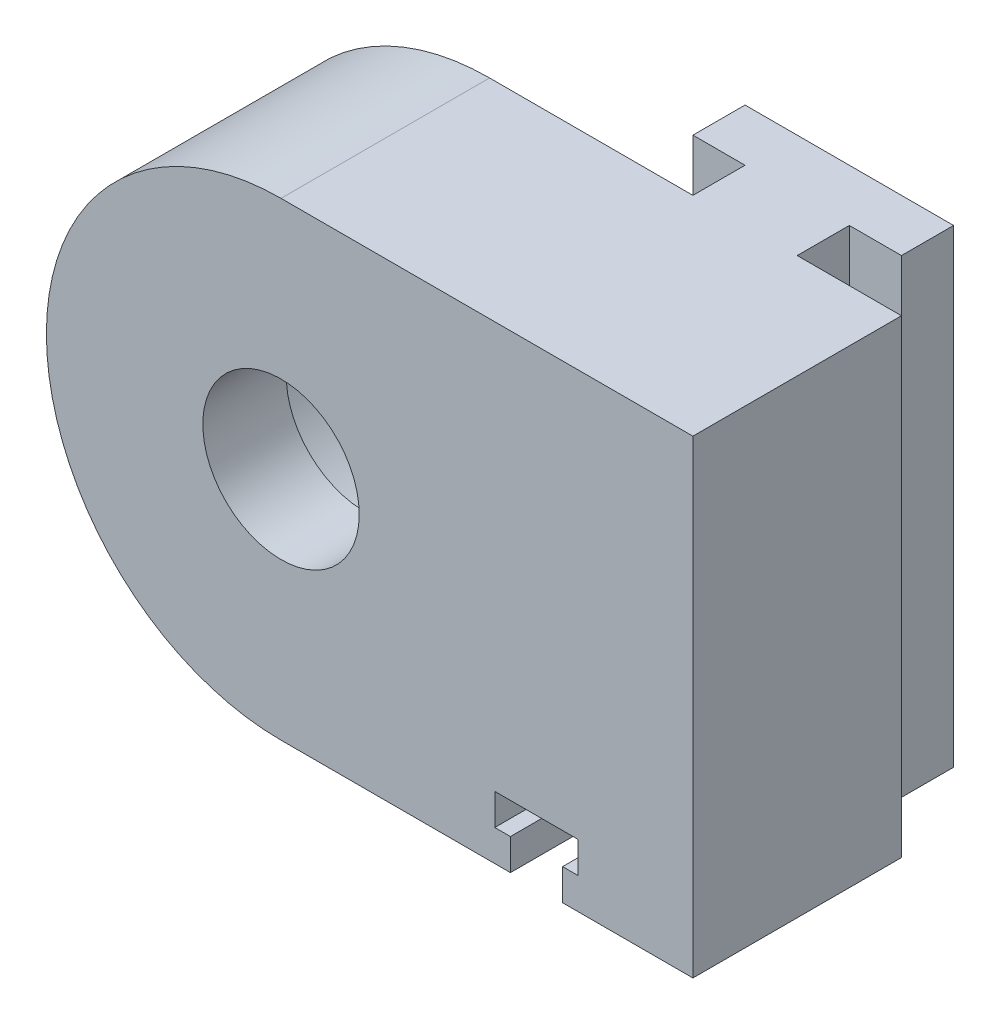
ISO-10303-21;
HEADER;
FILE_DESCRIPTION(('STEP AP214'),'2;1');
FILE_NAME('part.step','',(''),(''),'','','');
FILE_SCHEMA(('AUTOMOTIVE_DESIGN { 1 0 10303 214 1 1 1 1 }'));
ENDSEC;
DATA;
#1=APPLICATION_CONTEXT('core data for automotive mechanical design processes');
#2=APPLICATION_PROTOCOL_DEFINITION('international standard','automotive_design',2000,#1);
#3=PRODUCT_CONTEXT('',#1,'mechanical');
#4=PRODUCT('Part','Part','',(#3));
#5=PRODUCT_RELATED_PRODUCT_CATEGORY('part','',(#4));
#6=PRODUCT_DEFINITION_FORMATION('','',#4);
#7=PRODUCT_DEFINITION_CONTEXT('part definition',#1,'design');
#8=PRODUCT_DEFINITION('design','',#6,#7);
#9=PRODUCT_DEFINITION_SHAPE('','',#8);
#10=(LENGTH_UNIT() NAMED_UNIT(*) SI_UNIT(.MILLI.,.METRE.));
#11=(NAMED_UNIT(*) PLANE_ANGLE_UNIT() SI_UNIT($,.RADIAN.));
#12=(NAMED_UNIT(*) SI_UNIT($,.STERADIAN.) SOLID_ANGLE_UNIT());
#13=UNCERTAINTY_MEASURE_WITH_UNIT(LENGTH_MEASURE(1.E-05),#10,'distance_accuracy_value','');
#14=(GEOMETRIC_REPRESENTATION_CONTEXT(3) GLOBAL_UNCERTAINTY_ASSIGNED_CONTEXT((#13)) GLOBAL_UNIT_ASSIGNED_CONTEXT((#10,
#11,#12)) REPRESENTATION_CONTEXT('',''));
#15=CARTESIAN_POINT('',(0.,0.,0.));
#16=DIRECTION('',(0.,0.,1.));
#17=DIRECTION('',(1.,0.,0.));
#18=AXIS2_PLACEMENT_3D('',#15,#16,#17);
#19=CARTESIAN_POINT('',(-634.508066615171,-1.99999999999969,10.));
#20=DIRECTION('',(0.,0.,1.));
#21=DIRECTION('',(1.,0.,0.));
#22=AXIS2_PLACEMENT_3D('',#19,#20,#21);
#23=PLANE('',#22);
#24=CARTESIAN_POINT('',(-634.508066615171,-1.99999999999969,10.));
#25=DIRECTION('',(0.,0.,1.));
#26=DIRECTION('',(1.,0.,0.));
#27=AXIS2_PLACEMENT_3D('',#24,#25,#26);
#28=CIRCLE('',#27,7.49999999999996);
#29=CARTESIAN_POINT('',(-627.008066615171,-1.99999999999969,10.));
#30=VERTEX_POINT('',#29);
#31=EDGE_CURVE('E315',#30,#30,#28,.T.);
#32=ORIENTED_EDGE('',*,*,#31,.F.);
#33=EDGE_LOOP('',(#32));
#34=FACE_BOUND('',#33,.T.);
#35=DIRECTION('',(-1.,0.,0.));
#36=VECTOR('',#35,1.);
#37=CARTESIAN_POINT('',(-595.008671928237,-24.4999999999993,10.));
#38=LINE('',#37,#36);
#39=CARTESIAN_POINT('',(-612.508671928237,-24.4999999999993,10.));
#40=VERTEX_POINT('',#39);
#41=CARTESIAN_POINT('',(-634.508066615171,-24.4999999999993,10.));
#42=VERTEX_POINT('',#41);
#43=EDGE_CURVE('E326',#40,#42,#38,.T.);
#44=ORIENTED_EDGE('',*,*,#43,.F.);
#45=DIRECTION('',(0.,-1.,0.));
#46=VECTOR('',#45,1.);
#47=CARTESIAN_POINT('',(-612.508671928236,2.26673743452435E-11,10.));
#48=LINE('',#47,#46);
#49=CARTESIAN_POINT('',(-612.508671928237,-21.4999999999993,10.));
#50=VERTEX_POINT('',#49);
#51=EDGE_CURVE('E225',#50,#40,#48,.T.);
#52=ORIENTED_EDGE('',*,*,#51,.F.);
#53=DIRECTION('',(1.,0.,0.));
#54=VECTOR('',#53,1.);
#55=CARTESIAN_POINT('',(0.,-21.4999999999993,10.));
#56=LINE('',#55,#54);
#57=CARTESIAN_POINT('',(-614.008671928237,-21.4999999999993,10.));
#58=VERTEX_POINT('',#57);
#59=EDGE_CURVE('E223',#58,#50,#56,.T.);
#60=ORIENTED_EDGE('',*,*,#59,.F.);
#61=DIRECTION('',(0.,1.,0.));
#62=VECTOR('',#61,1.);
#63=CARTESIAN_POINT('',(-614.008671928237,0.,10.));
#64=LINE('',#63,#62);
#65=CARTESIAN_POINT('',(-614.008671928237,-18.4999999999993,10.));
#66=VERTEX_POINT('',#65);
#67=EDGE_CURVE('E191',#58,#66,#64,.T.);
#68=ORIENTED_EDGE('',*,*,#67,.T.);
#69=DIRECTION('',(1.,0.,0.));
#70=VECTOR('',#69,1.);
#71=CARTESIAN_POINT('',(0.,-18.4999999999993,10.));
#72=LINE('',#71,#70);
#73=CARTESIAN_POINT('',(-606.008671928237,-18.4999999999993,10.));
#74=VERTEX_POINT('',#73);
#75=EDGE_CURVE('E236',#66,#74,#72,.T.);
#76=ORIENTED_EDGE('',*,*,#75,.T.);
#77=DIRECTION('',(0.,-1.,0.));
#78=VECTOR('',#77,1.);
#79=CARTESIAN_POINT('',(-606.008671928237,0.,10.));
#80=LINE('',#79,#78);
#81=CARTESIAN_POINT('',(-606.008671928237,-21.4999999999993,10.));
#82=VERTEX_POINT('',#81);
#83=EDGE_CURVE('E233',#74,#82,#80,.T.);
#84=ORIENTED_EDGE('',*,*,#83,.T.);
#85=DIRECTION('',(-1.,0.,0.));
#86=VECTOR('',#85,1.);
#87=CARTESIAN_POINT('',(0.,-21.4999999999993,10.));
#88=LINE('',#87,#86);
#89=CARTESIAN_POINT('',(-607.508671928237,-21.4999999999993,10.));
#90=VERTEX_POINT('',#89);
#91=EDGE_CURVE('E230',#82,#90,#88,.T.);
#92=ORIENTED_EDGE('',*,*,#91,.T.);
#93=DIRECTION('',(0.,-1.,0.));
#94=VECTOR('',#93,1.);
#95=CARTESIAN_POINT('',(-607.508671928237,0.,10.));
#96=LINE('',#95,#94);
#97=CARTESIAN_POINT('',(-607.508671928237,-24.4999999999993,10.));
#98=VERTEX_POINT('',#97);
#99=EDGE_CURVE('E227',#90,#98,#96,.T.);
#100=ORIENTED_EDGE('',*,*,#99,.T.);
#101=CARTESIAN_POINT('',(-595.008671928237,-24.4999999999993,10.));
#102=VERTEX_POINT('',#101);
#103=EDGE_CURVE('E327',#102,#98,#38,.T.);
#104=ORIENTED_EDGE('',*,*,#103,.F.);
#105=DIRECTION('',(0.,-1.,0.));
#106=VECTOR('',#105,1.);
#107=CARTESIAN_POINT('',(-595.008671928237,20.4999999999999,10.));
#108=LINE('',#107,#106);
#109=CARTESIAN_POINT('',(-595.008671928237,20.4999999999999,10.));
#110=VERTEX_POINT('',#109);
#111=EDGE_CURVE('E322',#110,#102,#108,.T.);
#112=ORIENTED_EDGE('',*,*,#111,.F.);
#113=DIRECTION('',(1.,0.,0.));
#114=VECTOR('',#113,1.);
#115=CARTESIAN_POINT('',(-634.508066615171,20.4999999999999,10.));
#116=LINE('',#115,#114);
#117=CARTESIAN_POINT('',(-634.508066615171,20.4999999999999,10.));
#118=VERTEX_POINT('',#117);
#119=EDGE_CURVE('E319',#118,#110,#116,.T.);
#120=ORIENTED_EDGE('',*,*,#119,.F.);
#121=CARTESIAN_POINT('',(-634.508066615171,-1.99999999999969,10.));
#122=DIRECTION('',(0.,0.,1.));
#123=DIRECTION('',(1.,0.,0.));
#124=AXIS2_PLACEMENT_3D('',#121,#122,#123);
#125=CIRCLE('',#124,22.4999999999996);
#126=EDGE_CURVE('E330',#118,#42,#125,.T.);
#127=ORIENTED_EDGE('',*,*,#126,.T.);
#128=EDGE_LOOP('',(#44,#52,#60,#68,#76,#84,#92,#100,#104,#112,#120,#127));
#129=FACE_BOUND('',#128,.T.);
#130=ADVANCED_FACE('F51',(#34,#129),#23,.T.);
#131=CARTESIAN_POINT('',(-595.008671928237,-24.4999999999993,10.));
#132=DIRECTION('',(0.,-1.,0.));
#133=DIRECTION('',(1.,0.,0.));
#134=AXIS2_PLACEMENT_3D('',#131,#132,#133);
#135=PLANE('',#134);
#136=DIRECTION('',(-1.,0.,0.));
#137=VECTOR('',#136,1.);
#138=CARTESIAN_POINT('',(-600.008671928237,-24.5000000000001,-20.));
#139=LINE('',#138,#137);
#140=CARTESIAN_POINT('',(-612.508671928237,-24.4999999999993,-20.));
#141=VERTEX_POINT('',#140);
#142=CARTESIAN_POINT('',(-620.008671928237,-24.5000000000001,-20.));
#143=VERTEX_POINT('',#142);
#144=EDGE_CURVE('E263',#141,#143,#139,.T.);
#145=ORIENTED_EDGE('',*,*,#144,.F.);
#146=DIRECTION('',(0.,0.,-1.));
#147=VECTOR('',#146,1.);
#148=CARTESIAN_POINT('',(-612.508671928237,-24.4999999999993,10.));
#149=LINE('',#148,#147);
#150=EDGE_CURVE('E250',#40,#141,#149,.T.);
#151=ORIENTED_EDGE('',*,*,#150,.F.);
#152=ORIENTED_EDGE('',*,*,#43,.T.);
#153=DIRECTION('',(0.,0.,-1.));
#154=VECTOR('',#153,1.);
#155=CARTESIAN_POINT('',(-634.508066615171,-24.4999999999993,10.));
#156=LINE('',#155,#154);
#157=CARTESIAN_POINT('',(-634.508066615171,-24.4999999999993,-10.));
#158=VERTEX_POINT('',#157);
#159=EDGE_CURVE('E60',#42,#158,#156,.T.);
#160=ORIENTED_EDGE('',*,*,#159,.T.);
#161=DIRECTION('',(-1.,0.,0.));
#162=VECTOR('',#161,1.);
#163=CARTESIAN_POINT('',(-595.008671928237,-24.4999999999993,-10.));
#164=LINE('',#163,#162);
#165=CARTESIAN_POINT('',(-615.008671928237,-24.5000000000001,-10.));
#166=VERTEX_POINT('',#165);
#167=EDGE_CURVE('E340',#166,#158,#164,.T.);
#168=ORIENTED_EDGE('',*,*,#167,.F.);
#169=DIRECTION('',(0.,0.,1.));
#170=VECTOR('',#169,1.);
#171=CARTESIAN_POINT('',(-615.008671928237,-24.5000000000001,-15.));
#172=LINE('',#171,#170);
#173=CARTESIAN_POINT('',(-615.008671928237,-24.5000000000001,-15.));
#174=VERTEX_POINT('',#173);
#175=EDGE_CURVE('E273',#174,#166,#172,.T.);
#176=ORIENTED_EDGE('',*,*,#175,.F.);
#177=DIRECTION('',(1.,0.,0.));
#178=VECTOR('',#177,1.);
#179=CARTESIAN_POINT('',(-620.008671928237,-24.5000000000001,-15.));
#180=LINE('',#179,#178);
#181=CARTESIAN_POINT('',(-620.008671928237,-24.5000000000001,-15.));
#182=VERTEX_POINT('',#181);
#183=EDGE_CURVE('E270',#182,#174,#180,.T.);
#184=ORIENTED_EDGE('',*,*,#183,.F.);
#185=DIRECTION('',(0.,0.,1.));
#186=VECTOR('',#185,1.);
#187=CARTESIAN_POINT('',(-620.008671928237,-24.5000000000001,-20.));
#188=LINE('',#187,#186);
#189=EDGE_CURVE('E267',#143,#182,#188,.T.);
#190=ORIENTED_EDGE('',*,*,#189,.F.);
#191=EDGE_LOOP('',(#145,#151,#152,#160,#168,#176,#184,#190));
#192=FACE_BOUND('',#191,.T.);
#193=ADVANCED_FACE('F393',(#192),#135,.T.);
#194=CARTESIAN_POINT('',(-600.008671928237,-24.5000000000001,-20.));
#195=DIRECTION('',(0.,0.,-1.));
#196=DIRECTION('',(-1.,0.,0.));
#197=AXIS2_PLACEMENT_3D('',#194,#195,#196);
#198=PLANE('',#197);
#199=DIRECTION('',(1.,0.,0.));
#200=VECTOR('',#199,1.);
#201=CARTESIAN_POINT('',(0.,-21.4999999999993,-20.));
#202=LINE('',#201,#200);
#203=CARTESIAN_POINT('',(-614.008671928237,-21.4999999999993,-20.));
#204=VERTEX_POINT('',#203);
#205=CARTESIAN_POINT('',(-612.508671928237,-21.4999999999993,-20.));
#206=VERTEX_POINT('',#205);
#207=EDGE_CURVE('E197',#204,#206,#202,.T.);
#208=ORIENTED_EDGE('',*,*,#207,.T.);
#209=DIRECTION('',(0.,-1.,0.));
#210=VECTOR('',#209,1.);
#211=CARTESIAN_POINT('',(-612.508671928236,2.26673743452435E-11,-20.));
#212=LINE('',#211,#210);
#213=EDGE_CURVE('E203',#206,#141,#212,.T.);
#214=ORIENTED_EDGE('',*,*,#213,.T.);
#215=ORIENTED_EDGE('',*,*,#144,.T.);
#216=DIRECTION('',(0.,1.,0.));
#217=VECTOR('',#216,1.);
#218=CARTESIAN_POINT('',(-620.008671928237,-24.5000000000001,-20.));
#219=LINE('',#218,#217);
#220=CARTESIAN_POINT('',(-620.008671928237,20.4999999999999,-20.));
#221=VERTEX_POINT('',#220);
#222=EDGE_CURVE('E301',#143,#221,#219,.T.);
#223=ORIENTED_EDGE('',*,*,#222,.T.);
#224=DIRECTION('',(-1.,0.,0.));
#225=VECTOR('',#224,1.);
#226=CARTESIAN_POINT('',(-600.008671928237,20.4999999999999,-20.));
#227=LINE('',#226,#225);
#228=CARTESIAN_POINT('',(-600.008671928237,20.4999999999999,-20.));
#229=VERTEX_POINT('',#228);
#230=EDGE_CURVE('E283',#229,#221,#227,.T.);
#231=ORIENTED_EDGE('',*,*,#230,.F.);
#232=DIRECTION('',(0.,1.,0.));
#233=VECTOR('',#232,1.);
#234=CARTESIAN_POINT('',(-600.008671928237,-24.5000000000001,-20.));
#235=LINE('',#234,#233);
#236=CARTESIAN_POINT('',(-600.008671928237,-24.5000000000001,-20.));
#237=VERTEX_POINT('',#236);
#238=EDGE_CURVE('E303',#237,#229,#235,.T.);
#239=ORIENTED_EDGE('',*,*,#238,.F.);
#240=CARTESIAN_POINT('',(-607.508671928237,-24.4999999999993,-20.));
#241=VERTEX_POINT('',#240);
#242=EDGE_CURVE('E264',#237,#241,#139,.T.);
#243=ORIENTED_EDGE('',*,*,#242,.T.);
#244=DIRECTION('',(0.,-1.,0.));
#245=VECTOR('',#244,1.);
#246=CARTESIAN_POINT('',(-607.508671928237,0.,-20.));
#247=LINE('',#246,#245);
#248=CARTESIAN_POINT('',(-607.508671928237,-21.4999999999993,-20.));
#249=VERTEX_POINT('',#248);
#250=EDGE_CURVE('E213',#249,#241,#247,.T.);
#251=ORIENTED_EDGE('',*,*,#250,.F.);
#252=DIRECTION('',(-1.,0.,0.));
#253=VECTOR('',#252,1.);
#254=CARTESIAN_POINT('',(0.,-21.4999999999993,-20.));
#255=LINE('',#254,#253);
#256=CARTESIAN_POINT('',(-606.008671928237,-21.4999999999993,-20.));
#257=VERTEX_POINT('',#256);
#258=EDGE_CURVE('E215',#257,#249,#255,.T.);
#259=ORIENTED_EDGE('',*,*,#258,.F.);
#260=DIRECTION('',(0.,-1.,0.));
#261=VECTOR('',#260,1.);
#262=CARTESIAN_POINT('',(-606.008671928237,0.,-20.));
#263=LINE('',#262,#261);
#264=CARTESIAN_POINT('',(-606.008671928237,-18.4999999999993,-20.));
#265=VERTEX_POINT('',#264);
#266=EDGE_CURVE('E218',#265,#257,#263,.T.);
#267=ORIENTED_EDGE('',*,*,#266,.F.);
#268=DIRECTION('',(1.,0.,0.));
#269=VECTOR('',#268,1.);
#270=CARTESIAN_POINT('',(0.,-18.4999999999993,-20.));
#271=LINE('',#270,#269);
#272=CARTESIAN_POINT('',(-614.008671928237,-18.4999999999993,-20.));
#273=VERTEX_POINT('',#272);
#274=EDGE_CURVE('E209',#273,#265,#271,.T.);
#275=ORIENTED_EDGE('',*,*,#274,.F.);
#276=DIRECTION('',(0.,1.,0.));
#277=VECTOR('',#276,1.);
#278=CARTESIAN_POINT('',(-614.008671928237,0.,-20.));
#279=LINE('',#278,#277);
#280=EDGE_CURVE('E68',#204,#273,#279,.T.);
#281=ORIENTED_EDGE('',*,*,#280,.F.);
#282=EDGE_LOOP('',(#208,#214,#215,#223,#231,#239,#243,#251,#259,#267,#275,#281));
#283=FACE_BOUND('',#282,.T.);
#284=ADVANCED_FACE('F206',(#283),#198,.T.);
#285=CARTESIAN_POINT('',(-634.508066615171,-1.99999999999969,-10.));
#286=DIRECTION('',(0.,0.,1.));
#287=DIRECTION('',(1.,0.,0.));
#288=AXIS2_PLACEMENT_3D('',#285,#286,#287);
#289=PLANE('',#288);
#290=CARTESIAN_POINT('',(-634.508066615171,-1.99999999999969,-10.));
#291=DIRECTION('',(0.,0.,1.));
#292=DIRECTION('',(1.,0.,0.));
#293=AXIS2_PLACEMENT_3D('',#290,#291,#292);
#294=CIRCLE('',#293,14.);
#295=CARTESIAN_POINT('',(-620.508066615171,-1.99999999999969,-10.));
#296=VERTEX_POINT('',#295);
#297=EDGE_CURVE('E296',#296,#296,#294,.T.);
#298=ORIENTED_EDGE('',*,*,#297,.T.);
#299=EDGE_LOOP('',(#298));
#300=FACE_BOUND('',#299,.T.);
#301=DIRECTION('',(0.,1.,0.));
#302=VECTOR('',#301,1.);
#303=CARTESIAN_POINT('',(-615.008671928237,-24.5000000000001,-10.));
#304=LINE('',#303,#302);
#305=CARTESIAN_POINT('',(-615.008671928237,20.4999999999999,-10.));
#306=VERTEX_POINT('',#305);
#307=EDGE_CURVE('E294',#166,#306,#304,.T.);
#308=ORIENTED_EDGE('',*,*,#307,.F.);
#309=ORIENTED_EDGE('',*,*,#167,.T.);
#310=CARTESIAN_POINT('',(-634.508066615171,-1.99999999999969,-10.));
#311=DIRECTION('',(0.,0.,1.));
#312=DIRECTION('',(1.,0.,0.));
#313=AXIS2_PLACEMENT_3D('',#310,#311,#312);
#314=CIRCLE('',#313,22.4999999999996);
#315=CARTESIAN_POINT('',(-634.508066615171,20.4999999999999,-10.));
#316=VERTEX_POINT('',#315);
#317=EDGE_CURVE('E323',#316,#158,#314,.T.);
#318=ORIENTED_EDGE('',*,*,#317,.F.);
#319=DIRECTION('',(1.,0.,0.));
#320=VECTOR('',#319,1.);
#321=CARTESIAN_POINT('',(-634.508066615171,20.4999999999999,-10.));
#322=LINE('',#321,#320);
#323=EDGE_CURVE('E334',#316,#306,#322,.T.);
#324=ORIENTED_EDGE('',*,*,#323,.T.);
#325=EDGE_LOOP('',(#308,#309,#318,#324));
#326=FACE_BOUND('',#325,.T.);
#327=ADVANCED_FACE('F390',(#300,#326),#289,.F.);
#328=CARTESIAN_POINT('',(-595.008671928237,-24.4999999999993,-10.));
#329=VERTEX_POINT('',#328);
#330=CARTESIAN_POINT('',(-605.008671928237,-24.5000000000001,-10.));
#331=VERTEX_POINT('',#330);
#332=EDGE_CURVE('E341',#329,#331,#164,.T.);
#333=ORIENTED_EDGE('',*,*,#332,.T.);
#334=DIRECTION('',(0.,1.,0.));
#335=VECTOR('',#334,1.);
#336=CARTESIAN_POINT('',(-605.008671928237,-24.5000000000001,-10.));
#337=LINE('',#336,#335);
#338=CARTESIAN_POINT('',(-605.008671928237,20.4999999999999,-10.));
#339=VERTEX_POINT('',#338);
#340=EDGE_CURVE('E275',#331,#339,#337,.T.);
#341=ORIENTED_EDGE('',*,*,#340,.T.);
#342=CARTESIAN_POINT('',(-595.008671928237,20.4999999999999,-10.));
#343=VERTEX_POINT('',#342);
#344=EDGE_CURVE('E318',#339,#343,#322,.T.);
#345=ORIENTED_EDGE('',*,*,#344,.T.);
#346=DIRECTION('',(0.,-1.,0.));
#347=VECTOR('',#346,1.);
#348=CARTESIAN_POINT('',(-595.008671928237,20.4999999999999,-10.));
#349=LINE('',#348,#347);
#350=EDGE_CURVE('E337',#343,#329,#349,.T.);
#351=ORIENTED_EDGE('',*,*,#350,.T.);
#352=EDGE_LOOP('',(#333,#341,#345,#351));
#353=FACE_BOUND('',#352,.T.);
#354=ADVANCED_FACE('F360',(#353),#289,.F.);
#355=CARTESIAN_POINT('',(-634.508066615171,20.4999999999999,10.));
#356=DIRECTION('',(0.,1.,0.));
#357=DIRECTION('',(0.,0.,1.));
#358=AXIS2_PLACEMENT_3D('',#355,#356,#357);
#359=PLANE('',#358);
#360=ORIENTED_EDGE('',*,*,#323,.F.);
#361=DIRECTION('',(0.,0.,-1.));
#362=VECTOR('',#361,1.);
#363=CARTESIAN_POINT('',(-634.508066615171,20.4999999999999,10.));
#364=LINE('',#363,#362);
#365=EDGE_CURVE('E12',#118,#316,#364,.T.);
#366=ORIENTED_EDGE('',*,*,#365,.F.);
#367=ORIENTED_EDGE('',*,*,#119,.T.);
#368=DIRECTION('',(0.,0.,-1.));
#369=VECTOR('',#368,1.);
#370=CARTESIAN_POINT('',(-595.008671928237,20.4999999999999,10.));
#371=LINE('',#370,#369);
#372=EDGE_CURVE('E333',#110,#343,#371,.T.);
#373=ORIENTED_EDGE('',*,*,#372,.T.);
#374=ORIENTED_EDGE('',*,*,#344,.F.);
#375=DIRECTION('',(0.,0.,-1.));
#376=VECTOR('',#375,1.);
#377=CARTESIAN_POINT('',(-605.008671928237,20.4999999999999,-10.));
#378=LINE('',#377,#376);
#379=CARTESIAN_POINT('',(-605.008671928237,20.4999999999999,-15.));
#380=VERTEX_POINT('',#379);
#381=EDGE_CURVE('E76',#339,#380,#378,.T.);
#382=ORIENTED_EDGE('',*,*,#381,.T.);
#383=DIRECTION('',(1.,0.,0.));
#384=VECTOR('',#383,1.);
#385=CARTESIAN_POINT('',(-605.008671928237,20.4999999999999,-15.));
#386=LINE('',#385,#384);
#387=CARTESIAN_POINT('',(-600.008671928237,20.4999999999999,-15.));
#388=VERTEX_POINT('',#387);
#389=EDGE_CURVE('E277',#380,#388,#386,.T.);
#390=ORIENTED_EDGE('',*,*,#389,.T.);
#391=DIRECTION('',(0.,0.,-1.));
#392=VECTOR('',#391,1.);
#393=CARTESIAN_POINT('',(-600.008671928237,20.4999999999999,-15.));
#394=LINE('',#393,#392);
#395=EDGE_CURVE('E280',#388,#229,#394,.T.);
#396=ORIENTED_EDGE('',*,*,#395,.T.);
#397=ORIENTED_EDGE('',*,*,#230,.T.);
#398=DIRECTION('',(0.,0.,1.));
#399=VECTOR('',#398,1.);
#400=CARTESIAN_POINT('',(-620.008671928237,20.4999999999999,-20.));
#401=LINE('',#400,#399);
#402=CARTESIAN_POINT('',(-620.008671928237,20.4999999999999,-15.));
#403=VERTEX_POINT('',#402);
#404=EDGE_CURVE('E286',#221,#403,#401,.T.);
#405=ORIENTED_EDGE('',*,*,#404,.T.);
#406=DIRECTION('',(1.,0.,0.));
#407=VECTOR('',#406,1.);
#408=CARTESIAN_POINT('',(-620.008671928237,20.4999999999999,-15.));
#409=LINE('',#408,#407);
#410=CARTESIAN_POINT('',(-615.008671928237,20.4999999999999,-15.));
#411=VERTEX_POINT('',#410);
#412=EDGE_CURVE('E289',#403,#411,#409,.T.);
#413=ORIENTED_EDGE('',*,*,#412,.T.);
#414=DIRECTION('',(0.,0.,1.));
#415=VECTOR('',#414,1.);
#416=CARTESIAN_POINT('',(-615.008671928237,20.4999999999999,-15.));
#417=LINE('',#416,#415);
#418=EDGE_CURVE('E257',#411,#306,#417,.T.);
#419=ORIENTED_EDGE('',*,*,#418,.T.);
#420=EDGE_LOOP('',(#360,#366,#367,#373,#374,#382,#390,#396,#397,#405,#413,#419));
#421=FACE_BOUND('',#420,.T.);
#422=ADVANCED_FACE('F53',(#421),#359,.T.);
#423=CARTESIAN_POINT('',(-634.508066615171,-1.99999999999969,10.));
#424=DIRECTION('',(0.,0.,-1.));
#425=DIRECTION('',(-1.,0.,0.));
#426=AXIS2_PLACEMENT_3D('',#423,#424,#425);
#427=CYLINDRICAL_SURFACE('',#426,22.4999999999996);
#428=ORIENTED_EDGE('',*,*,#317,.T.);
#429=ORIENTED_EDGE('',*,*,#159,.F.);
#430=ORIENTED_EDGE('',*,*,#126,.F.);
#431=ORIENTED_EDGE('',*,*,#365,.T.);
#432=EDGE_LOOP('',(#428,#429,#430,#431));
#433=FACE_BOUND('',#432,.T.);
#434=ADVANCED_FACE('F400',(#433),#427,.T.);
#435=DIRECTION('',(0.,0.,-1.));
#436=VECTOR('',#435,1.);
#437=CARTESIAN_POINT('',(-607.508671928237,-24.4999999999993,10.));
#438=LINE('',#437,#436);
#439=EDGE_CURVE('E247',#98,#241,#438,.T.);
#440=ORIENTED_EDGE('',*,*,#439,.T.);
#441=ORIENTED_EDGE('',*,*,#242,.F.);
#442=DIRECTION('',(0.,0.,-1.));
#443=VECTOR('',#442,1.);
#444=CARTESIAN_POINT('',(-600.008671928237,-24.5000000000001,-15.));
#445=LINE('',#444,#443);
#446=CARTESIAN_POINT('',(-600.008671928237,-24.5000000000001,-15.));
#447=VERTEX_POINT('',#446);
#448=EDGE_CURVE('E260',#447,#237,#445,.T.);
#449=ORIENTED_EDGE('',*,*,#448,.F.);
#450=DIRECTION('',(1.,0.,0.));
#451=VECTOR('',#450,1.);
#452=CARTESIAN_POINT('',(-605.008671928237,-24.5000000000001,-15.));
#453=LINE('',#452,#451);
#454=CARTESIAN_POINT('',(-605.008671928237,-24.5000000000001,-15.));
#455=VERTEX_POINT('',#454);
#456=EDGE_CURVE('E256',#455,#447,#453,.T.);
#457=ORIENTED_EDGE('',*,*,#456,.F.);
#458=DIRECTION('',(0.,0.,-1.));
#459=VECTOR('',#458,1.);
#460=CARTESIAN_POINT('',(-605.008671928237,-24.5000000000001,-10.));
#461=LINE('',#460,#459);
#462=EDGE_CURVE('E253',#331,#455,#461,.T.);
#463=ORIENTED_EDGE('',*,*,#462,.F.);
#464=ORIENTED_EDGE('',*,*,#332,.F.);
#465=DIRECTION('',(0.,0.,-1.));
#466=VECTOR('',#465,1.);
#467=CARTESIAN_POINT('',(-595.008671928237,-24.4999999999993,10.));
#468=LINE('',#467,#466);
#469=EDGE_CURVE('E348',#102,#329,#468,.T.);
#470=ORIENTED_EDGE('',*,*,#469,.F.);
#471=ORIENTED_EDGE('',*,*,#103,.T.);
#472=EDGE_LOOP('',(#440,#441,#449,#457,#463,#464,#470,#471));
#473=FACE_BOUND('',#472,.T.);
#474=ADVANCED_FACE('F365',(#473),#135,.T.);
#475=CARTESIAN_POINT('',(-595.008671928237,20.4999999999999,10.));
#476=DIRECTION('',(1.,0.,0.));
#477=DIRECTION('',(0.,0.,-1.));
#478=AXIS2_PLACEMENT_3D('',#475,#476,#477);
#479=PLANE('',#478);
#480=ORIENTED_EDGE('',*,*,#350,.F.);
#481=ORIENTED_EDGE('',*,*,#372,.F.);
#482=ORIENTED_EDGE('',*,*,#111,.T.);
#483=ORIENTED_EDGE('',*,*,#469,.T.);
#484=EDGE_LOOP('',(#480,#481,#482,#483));
#485=FACE_BOUND('',#484,.T.);
#486=ADVANCED_FACE('F357',(#485),#479,.T.);
#487=CARTESIAN_POINT('',(-634.508066615171,-1.99999999999969,10.));
#488=DIRECTION('',(0.,0.,-1.));
#489=DIRECTION('',(-1.,0.,0.));
#490=AXIS2_PLACEMENT_3D('',#487,#488,#489);
#491=CYLINDRICAL_SURFACE('',#490,7.49999999999996);
#492=CARTESIAN_POINT('',(-634.508066615171,-1.99999999999969,2.));
#493=DIRECTION('',(0.,0.,1.));
#494=DIRECTION('',(1.,0.,0.));
#495=AXIS2_PLACEMENT_3D('',#492,#493,#494);
#496=CIRCLE('',#495,7.49999999999996);
#497=CARTESIAN_POINT('',(-627.008066615171,-1.99999999999969,2.));
#498=VERTEX_POINT('',#497);
#499=EDGE_CURVE('E55',#498,#498,#496,.T.);
#500=ORIENTED_EDGE('',*,*,#499,.F.);
#501=EDGE_LOOP('',(#500));
#502=FACE_BOUND('',#501,.T.);
#503=ORIENTED_EDGE('',*,*,#31,.T.);
#504=EDGE_LOOP('',(#503));
#505=FACE_BOUND('',#504,.T.);
#506=ADVANCED_FACE('F440',(#502,#505),#491,.F.);
#507=CARTESIAN_POINT('',(-634.508066615171,-1.99999999999969,2.));
#508=DIRECTION('',(0.,0.,-1.));
#509=DIRECTION('',(-1.,0.,0.));
#510=AXIS2_PLACEMENT_3D('',#507,#508,#509);
#511=CYLINDRICAL_SURFACE('',#510,14.);
#512=CARTESIAN_POINT('',(-634.508066615171,-1.99999999999969,2.));
#513=DIRECTION('',(0.,0.,1.));
#514=DIRECTION('',(1.,0.,0.));
#515=AXIS2_PLACEMENT_3D('',#512,#513,#514);
#516=CIRCLE('',#515,14.);
#517=CARTESIAN_POINT('',(-620.508066615171,-1.99999999999969,2.));
#518=VERTEX_POINT('',#517);
#519=EDGE_CURVE('E312',#518,#518,#516,.T.);
#520=ORIENTED_EDGE('',*,*,#519,.T.);
#521=EDGE_LOOP('',(#520));
#522=FACE_BOUND('',#521,.T.);
#523=ORIENTED_EDGE('',*,*,#297,.F.);
#524=EDGE_LOOP('',(#523));
#525=FACE_BOUND('',#524,.T.);
#526=ADVANCED_FACE('F450',(#522,#525),#511,.F.);
#527=CARTESIAN_POINT('',(-634.508066615171,-1.99999999999969,2.));
#528=DIRECTION('',(0.,0.,1.));
#529=DIRECTION('',(1.,0.,0.));
#530=AXIS2_PLACEMENT_3D('',#527,#528,#529);
#531=PLANE('',#530);
#532=ORIENTED_EDGE('',*,*,#499,.T.);
#533=EDGE_LOOP('',(#532));
#534=FACE_BOUND('',#533,.T.);
#535=ORIENTED_EDGE('',*,*,#519,.F.);
#536=EDGE_LOOP('',(#535));
#537=FACE_BOUND('',#536,.T.);
#538=ADVANCED_FACE('F428',(#534,#537),#531,.F.);
#539=CARTESIAN_POINT('',(-615.008671928237,-24.5000000000001,-15.));
#540=DIRECTION('',(-1.,0.,0.));
#541=DIRECTION('',(0.,0.,1.));
#542=AXIS2_PLACEMENT_3D('',#539,#540,#541);
#543=PLANE('',#542);
#544=ORIENTED_EDGE('',*,*,#418,.F.);
#545=DIRECTION('',(0.,1.,0.));
#546=VECTOR('',#545,1.);
#547=CARTESIAN_POINT('',(-615.008671928237,-24.5000000000001,-15.));
#548=LINE('',#547,#546);
#549=EDGE_CURVE('E297',#174,#411,#548,.T.);
#550=ORIENTED_EDGE('',*,*,#549,.F.);
#551=ORIENTED_EDGE('',*,*,#175,.T.);
#552=ORIENTED_EDGE('',*,*,#307,.T.);
#553=EDGE_LOOP('',(#544,#550,#551,#552));
#554=FACE_BOUND('',#553,.T.);
#555=ADVANCED_FACE('F385',(#554),#543,.T.);
#556=CARTESIAN_POINT('',(-620.008671928237,-24.5000000000001,-15.));
#557=DIRECTION('',(0.,0.,1.));
#558=DIRECTION('',(1.,0.,0.));
#559=AXIS2_PLACEMENT_3D('',#556,#557,#558);
#560=PLANE('',#559);
#561=ORIENTED_EDGE('',*,*,#412,.F.);
#562=DIRECTION('',(0.,1.,0.));
#563=VECTOR('',#562,1.);
#564=CARTESIAN_POINT('',(-620.008671928237,-24.5000000000001,-15.));
#565=LINE('',#564,#563);
#566=EDGE_CURVE('E299',#182,#403,#565,.T.);
#567=ORIENTED_EDGE('',*,*,#566,.F.);
#568=ORIENTED_EDGE('',*,*,#183,.T.);
#569=ORIENTED_EDGE('',*,*,#549,.T.);
#570=EDGE_LOOP('',(#561,#567,#568,#569));
#571=FACE_BOUND('',#570,.T.);
#572=ADVANCED_FACE('F420',(#571),#560,.T.);
#573=CARTESIAN_POINT('',(-620.008671928237,-24.5000000000001,-20.));
#574=DIRECTION('',(-1.,0.,0.));
#575=DIRECTION('',(0.,0.,1.));
#576=AXIS2_PLACEMENT_3D('',#573,#574,#575);
#577=PLANE('',#576);
#578=ORIENTED_EDGE('',*,*,#404,.F.);
#579=ORIENTED_EDGE('',*,*,#222,.F.);
#580=ORIENTED_EDGE('',*,*,#189,.T.);
#581=ORIENTED_EDGE('',*,*,#566,.T.);
#582=EDGE_LOOP('',(#578,#579,#580,#581));
#583=FACE_BOUND('',#582,.T.);
#584=ADVANCED_FACE('F380',(#583),#577,.T.);
#585=CARTESIAN_POINT('',(-600.008671928237,-24.5000000000001,-15.));
#586=DIRECTION('',(1.,0.,0.));
#587=DIRECTION('',(0.,0.,-1.));
#588=AXIS2_PLACEMENT_3D('',#585,#586,#587);
#589=PLANE('',#588);
#590=ORIENTED_EDGE('',*,*,#395,.F.);
#591=DIRECTION('',(0.,1.,0.));
#592=VECTOR('',#591,1.);
#593=CARTESIAN_POINT('',(-600.008671928237,-24.5000000000001,-15.));
#594=LINE('',#593,#592);
#595=EDGE_CURVE('E305',#447,#388,#594,.T.);
#596=ORIENTED_EDGE('',*,*,#595,.F.);
#597=ORIENTED_EDGE('',*,*,#448,.T.);
#598=ORIENTED_EDGE('',*,*,#238,.T.);
#599=EDGE_LOOP('',(#590,#596,#597,#598));
#600=FACE_BOUND('',#599,.T.);
#601=ADVANCED_FACE('F374',(#600),#589,.T.);
#602=CARTESIAN_POINT('',(-605.008671928237,-24.5000000000001,-15.));
#603=DIRECTION('',(0.,0.,1.));
#604=DIRECTION('',(1.,0.,0.));
#605=AXIS2_PLACEMENT_3D('',#602,#603,#604);
#606=PLANE('',#605);
#607=ORIENTED_EDGE('',*,*,#389,.F.);
#608=DIRECTION('',(0.,1.,0.));
#609=VECTOR('',#608,1.);
#610=CARTESIAN_POINT('',(-605.008671928237,-24.5000000000001,-15.));
#611=LINE('',#610,#609);
#612=EDGE_CURVE('E307',#455,#380,#611,.T.);
#613=ORIENTED_EDGE('',*,*,#612,.F.);
#614=ORIENTED_EDGE('',*,*,#456,.T.);
#615=ORIENTED_EDGE('',*,*,#595,.T.);
#616=EDGE_LOOP('',(#607,#613,#614,#615));
#617=FACE_BOUND('',#616,.T.);
#618=ADVANCED_FACE('F370',(#617),#606,.T.);
#619=CARTESIAN_POINT('',(-605.008671928237,-24.5000000000001,-10.));
#620=DIRECTION('',(1.,0.,0.));
#621=DIRECTION('',(0.,0.,-1.));
#622=AXIS2_PLACEMENT_3D('',#619,#620,#621);
#623=PLANE('',#622);
#624=ORIENTED_EDGE('',*,*,#381,.F.);
#625=ORIENTED_EDGE('',*,*,#340,.F.);
#626=ORIENTED_EDGE('',*,*,#462,.T.);
#627=ORIENTED_EDGE('',*,*,#612,.T.);
#628=EDGE_LOOP('',(#624,#625,#626,#627));
#629=FACE_BOUND('',#628,.T.);
#630=ADVANCED_FACE('F362',(#629),#623,.T.);
#631=CARTESIAN_POINT('',(-614.008671928237,0.,10.));
#632=DIRECTION('',(-1.,0.,0.));
#633=DIRECTION('',(0.,0.,1.));
#634=AXIS2_PLACEMENT_3D('',#631,#632,#633);
#635=PLANE('',#634);
#636=DIRECTION('',(0.,0.,-1.));
#637=VECTOR('',#636,1.);
#638=CARTESIAN_POINT('',(-614.008671928237,-18.4999999999993,10.));
#639=LINE('',#638,#637);
#640=EDGE_CURVE('E239',#66,#273,#639,.T.);
#641=ORIENTED_EDGE('',*,*,#640,.F.);
#642=ORIENTED_EDGE('',*,*,#67,.F.);
#643=DIRECTION('',(0.,0.,-1.));
#644=VECTOR('',#643,1.);
#645=CARTESIAN_POINT('',(-614.008671928237,-21.4999999999993,10.));
#646=LINE('',#645,#644);
#647=EDGE_CURVE('E187',#58,#204,#646,.T.);
#648=ORIENTED_EDGE('',*,*,#647,.T.);
#649=ORIENTED_EDGE('',*,*,#280,.T.);
#650=EDGE_LOOP('',(#641,#642,#648,#649));
#651=FACE_BOUND('',#650,.T.);
#652=ADVANCED_FACE('F189',(#651),#635,.F.);
#653=CARTESIAN_POINT('',(0.,-21.4999999999993,10.));
#654=DIRECTION('',(0.,1.,0.));
#655=DIRECTION('',(0.,0.,1.));
#656=AXIS2_PLACEMENT_3D('',#653,#654,#655);
#657=PLANE('',#656);
#658=ORIENTED_EDGE('',*,*,#647,.F.);
#659=ORIENTED_EDGE('',*,*,#59,.T.);
#660=DIRECTION('',(0.,0.,-1.));
#661=VECTOR('',#660,1.);
#662=CARTESIAN_POINT('',(-612.508671928237,-21.4999999999993,10.));
#663=LINE('',#662,#661);
#664=EDGE_CURVE('E194',#50,#206,#663,.T.);
#665=ORIENTED_EDGE('',*,*,#664,.T.);
#666=ORIENTED_EDGE('',*,*,#207,.F.);
#667=EDGE_LOOP('',(#658,#659,#665,#666));
#668=FACE_BOUND('',#667,.T.);
#669=ADVANCED_FACE('F198',(#668),#657,.T.);
#670=CARTESIAN_POINT('',(-612.508671928236,2.26673743452435E-11,10.));
#671=DIRECTION('',(1.,0.,0.));
#672=DIRECTION('',(0.,1.,0.));
#673=AXIS2_PLACEMENT_3D('',#670,#671,#672);
#674=PLANE('',#673);
#675=ORIENTED_EDGE('',*,*,#664,.F.);
#676=ORIENTED_EDGE('',*,*,#51,.T.);
#677=ORIENTED_EDGE('',*,*,#150,.T.);
#678=ORIENTED_EDGE('',*,*,#213,.F.);
#679=EDGE_LOOP('',(#675,#676,#677,#678));
#680=FACE_BOUND('',#679,.T.);
#681=ADVANCED_FACE('F419',(#680),#674,.T.);
#682=CARTESIAN_POINT('',(-607.508671928237,0.,10.));
#683=DIRECTION('',(1.,0.,0.));
#684=DIRECTION('',(0.,0.,-1.));
#685=AXIS2_PLACEMENT_3D('',#682,#683,#684);
#686=PLANE('',#685);
#687=ORIENTED_EDGE('',*,*,#439,.F.);
#688=ORIENTED_EDGE('',*,*,#99,.F.);
#689=DIRECTION('',(0.,0.,-1.));
#690=VECTOR('',#689,1.);
#691=CARTESIAN_POINT('',(-607.508671928237,-21.4999999999993,10.));
#692=LINE('',#691,#690);
#693=EDGE_CURVE('E245',#90,#249,#692,.T.);
#694=ORIENTED_EDGE('',*,*,#693,.T.);
#695=ORIENTED_EDGE('',*,*,#250,.T.);
#696=EDGE_LOOP('',(#687,#688,#694,#695));
#697=FACE_BOUND('',#696,.T.);
#698=ADVANCED_FACE('F407',(#697),#686,.F.);
#699=CARTESIAN_POINT('',(0.,-21.4999999999993,10.));
#700=DIRECTION('',(0.,-1.,0.));
#701=DIRECTION('',(0.,0.,-1.));
#702=AXIS2_PLACEMENT_3D('',#699,#700,#701);
#703=PLANE('',#702);
#704=ORIENTED_EDGE('',*,*,#693,.F.);
#705=ORIENTED_EDGE('',*,*,#91,.F.);
#706=DIRECTION('',(0.,0.,-1.));
#707=VECTOR('',#706,1.);
#708=CARTESIAN_POINT('',(-606.008671928237,-21.4999999999993,10.));
#709=LINE('',#708,#707);
#710=EDGE_CURVE('E243',#82,#257,#709,.T.);
#711=ORIENTED_EDGE('',*,*,#710,.T.);
#712=ORIENTED_EDGE('',*,*,#258,.T.);
#713=EDGE_LOOP('',(#704,#705,#711,#712));
#714=FACE_BOUND('',#713,.T.);
#715=ADVANCED_FACE('F410',(#714),#703,.F.);
#716=CARTESIAN_POINT('',(-606.008671928237,0.,10.));
#717=DIRECTION('',(1.,0.,0.));
#718=DIRECTION('',(0.,0.,-1.));
#719=AXIS2_PLACEMENT_3D('',#716,#717,#718);
#720=PLANE('',#719);
#721=ORIENTED_EDGE('',*,*,#710,.F.);
#722=ORIENTED_EDGE('',*,*,#83,.F.);
#723=DIRECTION('',(0.,0.,-1.));
#724=VECTOR('',#723,1.);
#725=CARTESIAN_POINT('',(-606.008671928237,-18.4999999999993,10.));
#726=LINE('',#725,#724);
#727=EDGE_CURVE('E241',#74,#265,#726,.T.);
#728=ORIENTED_EDGE('',*,*,#727,.T.);
#729=ORIENTED_EDGE('',*,*,#266,.T.);
#730=EDGE_LOOP('',(#721,#722,#728,#729));
#731=FACE_BOUND('',#730,.T.);
#732=ADVANCED_FACE('F413',(#731),#720,.F.);
#733=CARTESIAN_POINT('',(0.,-18.4999999999993,10.));
#734=DIRECTION('',(0.,1.,0.));
#735=DIRECTION('',(0.,0.,1.));
#736=AXIS2_PLACEMENT_3D('',#733,#734,#735);
#737=PLANE('',#736);
#738=ORIENTED_EDGE('',*,*,#727,.F.);
#739=ORIENTED_EDGE('',*,*,#75,.F.);
#740=ORIENTED_EDGE('',*,*,#640,.T.);
#741=ORIENTED_EDGE('',*,*,#274,.T.);
#742=EDGE_LOOP('',(#738,#739,#740,#741));
#743=FACE_BOUND('',#742,.T.);
#744=ADVANCED_FACE('F416',(#743),#737,.F.);
#745=CLOSED_SHELL('',(#130,#193,#284,#327,#354,#422,#434,#474,#486,#506,#526,#538,#555,#572,
#584,#601,#618,#630,#652,#669,#681,#698,#715,#732,#744));
#746=MANIFOLD_SOLID_BREP('B2',#745);
#747=ADVANCED_BREP_SHAPE_REPRESENTATION('',(#18,#746),#14);
#748=SHAPE_DEFINITION_REPRESENTATION(#9,#747);
ENDSEC;
END-ISO-10303-21;
